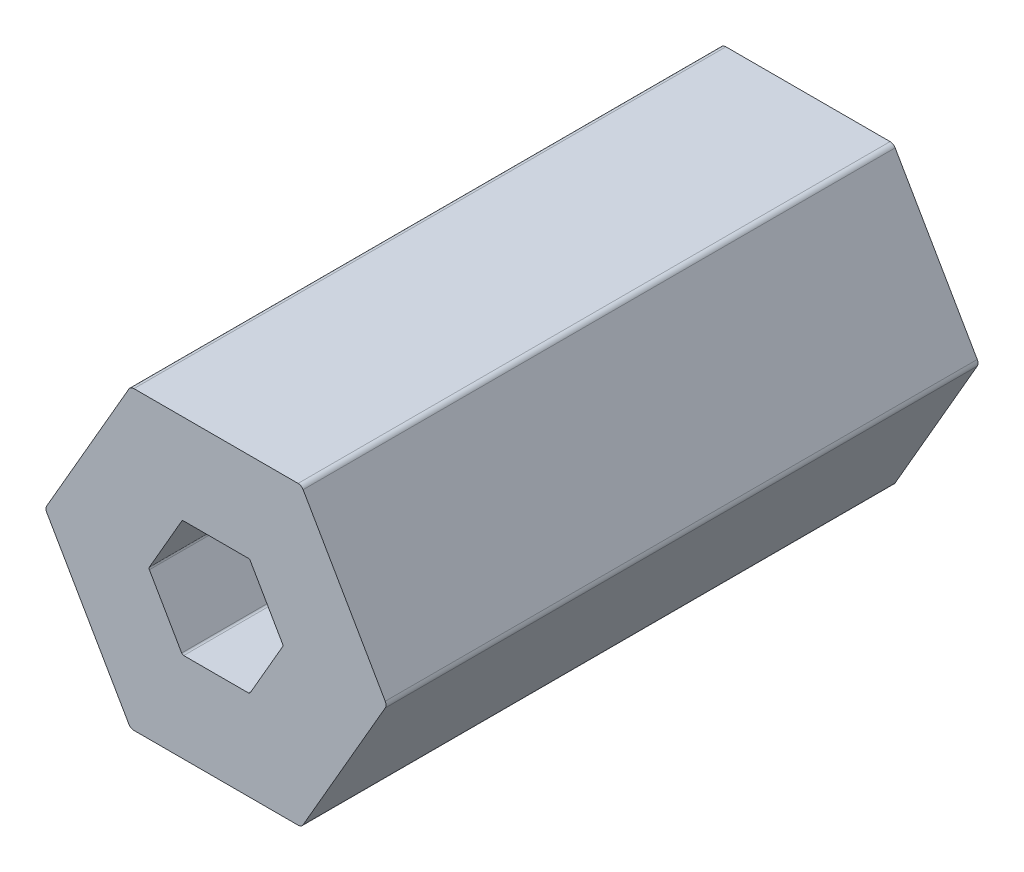
ISO-10303-21;
HEADER;
FILE_DESCRIPTION(('STEP AP214'),'2;1');
FILE_NAME('part.step','',(''),(''),'','','');
FILE_SCHEMA(('AUTOMOTIVE_DESIGN { 1 0 10303 214 1 1 1 1 }'));
ENDSEC;
DATA;
#1=APPLICATION_CONTEXT('core data for automotive mechanical design processes');
#2=APPLICATION_PROTOCOL_DEFINITION('international standard','automotive_design',2000,#1);
#3=PRODUCT_CONTEXT('',#1,'mechanical');
#4=PRODUCT('Part','Part','',(#3));
#5=PRODUCT_RELATED_PRODUCT_CATEGORY('part','',(#4));
#6=PRODUCT_DEFINITION_FORMATION('','',#4);
#7=PRODUCT_DEFINITION_CONTEXT('part definition',#1,'design');
#8=PRODUCT_DEFINITION('design','',#6,#7);
#9=PRODUCT_DEFINITION_SHAPE('','',#8);
#10=(LENGTH_UNIT() NAMED_UNIT(*) SI_UNIT(.MILLI.,.METRE.));
#11=(NAMED_UNIT(*) PLANE_ANGLE_UNIT() SI_UNIT($,.RADIAN.));
#12=(NAMED_UNIT(*) SI_UNIT($,.STERADIAN.) SOLID_ANGLE_UNIT());
#13=UNCERTAINTY_MEASURE_WITH_UNIT(LENGTH_MEASURE(1.E-05),#10,'distance_accuracy_value','');
#14=(GEOMETRIC_REPRESENTATION_CONTEXT(3) GLOBAL_UNCERTAINTY_ASSIGNED_CONTEXT((#13)) GLOBAL_UNIT_ASSIGNED_CONTEXT((#10,
#11,#12)) REPRESENTATION_CONTEXT('',''));
#15=CARTESIAN_POINT('',(0.,0.,0.));
#16=DIRECTION('',(0.,0.,1.));
#17=DIRECTION('',(1.,0.,0.));
#18=AXIS2_PLACEMENT_3D('',#15,#16,#17);
#19=CARTESIAN_POINT('',(2.77128129211021,0.,400.));
#20=DIRECTION('',(0.,0.,1.));
#21=DIRECTION('',(1.,0.,0.));
#22=AXIS2_PLACEMENT_3D('',#19,#20,#21);
#23=CYLINDRICAL_SURFACE('',#22,0.1);
#24=CARTESIAN_POINT('',(2.77128129211021,0.,25.4));
#25=DIRECTION('',(0.,0.,1.));
#26=DIRECTION('',(1.,0.,0.));
#27=AXIS2_PLACEMENT_3D('',#24,#25,#26);
#28=CIRCLE('',#27,0.1);
#29=CARTESIAN_POINT('',(2.85788383248865,0.0500000000000045,25.4));
#30=VERTEX_POINT('',#29);
#31=CARTESIAN_POINT('',(2.8712812921102,0.,25.4));
#32=VERTEX_POINT('',#31);
#33=EDGE_CURVE('E1064',#30,#32,#28,.F.);
#34=ORIENTED_EDGE('',*,*,#33,.F.);
#35=DIRECTION('',(0.,0.,1.));
#36=VECTOR('',#35,1.);
#37=CARTESIAN_POINT('',(2.85788383248865,0.0500000000000085,400.));
#38=LINE('',#37,#36);
#39=CARTESIAN_POINT('',(2.85788383248865,0.0500000000000084,0.));
#40=VERTEX_POINT('',#39);
#41=EDGE_CURVE('E389',#40,#30,#38,.T.);
#42=ORIENTED_EDGE('',*,*,#41,.F.);
#43=CARTESIAN_POINT('',(2.77128129211021,0.,0.));
#44=DIRECTION('',(0.,0.,1.));
#45=DIRECTION('',(1.,0.,0.));
#46=AXIS2_PLACEMENT_3D('',#43,#44,#45);
#47=CIRCLE('',#46,0.1);
#48=CARTESIAN_POINT('',(2.8712812921102,0.,0.));
#49=VERTEX_POINT('',#48);
#50=EDGE_CURVE('E282',#49,#40,#47,.T.);
#51=ORIENTED_EDGE('',*,*,#50,.F.);
#52=DIRECTION('',(0.,0.,1.));
#53=VECTOR('',#52,1.);
#54=CARTESIAN_POINT('',(2.8712812921102,0.,400.));
#55=LINE('',#54,#53);
#56=EDGE_CURVE('E54',#49,#32,#55,.T.);
#57=ORIENTED_EDGE('',*,*,#56,.T.);
#58=EDGE_LOOP('',(#34,#42,#51,#57));
#59=FACE_BOUND('',#58,.T.);
#60=ADVANCED_FACE('F45',(#59),#23,.F.);
#61=CARTESIAN_POINT('',(-7.04367328411341,0.,400.));
#62=DIRECTION('',(0.,0.,-1.));
#63=DIRECTION('',(-1.,0.,0.));
#64=AXIS2_PLACEMENT_3D('',#61,#62,#63);
#65=CYLINDRICAL_SURFACE('',#64,0.25);
#66=DIRECTION('',(0.,0.,-1.));
#67=VECTOR('',#66,1.);
#68=CARTESIAN_POINT('',(-7.26017963505952,-0.125000000000051,400.));
#69=LINE('',#68,#67);
#70=CARTESIAN_POINT('',(-7.26017963505952,-0.12500000000005,25.4));
#71=VERTEX_POINT('',#70);
#72=CARTESIAN_POINT('',(-7.26017963505952,-0.12500000000005,0.));
#73=VERTEX_POINT('',#72);
#74=EDGE_CURVE('E308',#71,#73,#69,.T.);
#75=ORIENTED_EDGE('',*,*,#74,.F.);
#76=CARTESIAN_POINT('',(-7.04367328411341,0.,25.4));
#77=DIRECTION('',(0.,0.,1.));
#78=DIRECTION('',(1.,0.,0.));
#79=AXIS2_PLACEMENT_3D('',#76,#77,#78);
#80=CIRCLE('',#79,0.25);
#81=CARTESIAN_POINT('',(-7.29367328411341,0.,25.4));
#82=VERTEX_POINT('',#81);
#83=EDGE_CURVE('E506',#71,#82,#80,.F.);
#84=ORIENTED_EDGE('',*,*,#83,.T.);
#85=DIRECTION('',(0.,0.,-1.));
#86=VECTOR('',#85,1.);
#87=CARTESIAN_POINT('',(-7.29367328411341,0.,400.));
#88=LINE('',#87,#86);
#89=CARTESIAN_POINT('',(-7.29367328411341,0.,0.));
#90=VERTEX_POINT('',#89);
#91=EDGE_CURVE('E336',#82,#90,#88,.T.);
#92=ORIENTED_EDGE('',*,*,#91,.T.);
#93=CARTESIAN_POINT('',(-7.04367328411341,0.,0.));
#94=DIRECTION('',(0.,0.,-1.));
#95=DIRECTION('',(1.,0.,0.));
#96=AXIS2_PLACEMENT_3D('',#93,#94,#95);
#97=CIRCLE('',#96,0.25);
#98=EDGE_CURVE('E324',#73,#90,#97,.T.);
#99=ORIENTED_EDGE('',*,*,#98,.F.);
#100=EDGE_LOOP('',(#75,#84,#92,#99));
#101=FACE_BOUND('',#100,.T.);
#102=ADVANCED_FACE('F1002',(#101),#65,.T.);
#103=CARTESIAN_POINT('',(3.66617420935418,-6.34999999999993,400.));
#104=DIRECTION('',(-0.866025403784442,0.5,0.));
#105=DIRECTION('',(0.,0.,1.));
#106=AXIS2_PLACEMENT_3D('',#103,#104,#105);
#107=PLANE('',#106);
#108=DIRECTION('',(0.499999999999999,0.866025403784439,0.));
#109=VECTOR('',#108,1.);
#110=CARTESIAN_POINT('',(3.66617420935418,-6.34999999999993,25.4));
#111=LINE('',#110,#109);
#112=CARTESIAN_POINT('',(3.73834299300289,-6.22499999999993,25.4));
#113=VERTEX_POINT('',#112);
#114=CARTESIAN_POINT('',(7.26017963505952,-0.125,25.4));
#115=VERTEX_POINT('',#114);
#116=EDGE_CURVE('E492',#113,#115,#111,.T.);
#117=ORIENTED_EDGE('',*,*,#116,.F.);
#118=DIRECTION('',(0.,0.,-1.));
#119=VECTOR('',#118,1.);
#120=CARTESIAN_POINT('',(3.73834299300288,-6.22499999999993,400.));
#121=LINE('',#120,#119);
#122=CARTESIAN_POINT('',(3.73834299300288,-6.22499999999993,0.));
#123=VERTEX_POINT('',#122);
#124=EDGE_CURVE('E331',#113,#123,#121,.T.);
#125=ORIENTED_EDGE('',*,*,#124,.T.);
#126=DIRECTION('',(0.5,0.866025403784442,0.));
#127=VECTOR('',#126,1.);
#128=CARTESIAN_POINT('',(3.66617420935418,-6.34999999999993,0.));
#129=LINE('',#128,#127);
#130=CARTESIAN_POINT('',(7.26017963505952,-0.125,0.));
#131=VERTEX_POINT('',#130);
#132=EDGE_CURVE('E328',#123,#131,#129,.T.);
#133=ORIENTED_EDGE('',*,*,#132,.T.);
#134=DIRECTION('',(0.,0.,1.));
#135=VECTOR('',#134,1.);
#136=CARTESIAN_POINT('',(7.26017963505952,-0.125,400.));
#137=LINE('',#136,#135);
#138=EDGE_CURVE('E332',#131,#115,#137,.T.);
#139=ORIENTED_EDGE('',*,*,#138,.T.);
#140=EDGE_LOOP('',(#117,#125,#133,#139));
#141=FACE_BOUND('',#140,.T.);
#142=ADVANCED_FACE('F546',(#141),#107,.F.);
#143=CARTESIAN_POINT('',(7.33234841870822,0.,400.));
#144=DIRECTION('',(-0.866025403784438,-0.5,0.));
#145=DIRECTION('',(-0.5,0.866025403784438,0.));
#146=AXIS2_PLACEMENT_3D('',#143,#144,#145);
#147=PLANE('',#146);
#148=DIRECTION('',(-0.5,0.866025403784438,0.));
#149=VECTOR('',#148,1.);
#150=CARTESIAN_POINT('',(7.33234841870822,0.,25.4));
#151=LINE('',#150,#149);
#152=CARTESIAN_POINT('',(7.26017963505952,0.125,25.4));
#153=VERTEX_POINT('',#152);
#154=CARTESIAN_POINT('',(3.7383429930028,6.225,25.4));
#155=VERTEX_POINT('',#154);
#156=EDGE_CURVE('E61',#153,#155,#151,.T.);
#157=ORIENTED_EDGE('',*,*,#156,.F.);
#158=DIRECTION('',(0.,0.,-1.));
#159=VECTOR('',#158,1.);
#160=CARTESIAN_POINT('',(7.26017963505952,0.125,400.));
#161=LINE('',#160,#159);
#162=CARTESIAN_POINT('',(7.26017963505952,0.125,0.));
#163=VERTEX_POINT('',#162);
#164=EDGE_CURVE('E304',#153,#163,#161,.T.);
#165=ORIENTED_EDGE('',*,*,#164,.T.);
#166=DIRECTION('',(-0.5,0.866025403784438,0.));
#167=VECTOR('',#166,1.);
#168=CARTESIAN_POINT('',(7.33234841870822,0.,0.));
#169=LINE('',#168,#167);
#170=CARTESIAN_POINT('',(3.7383429930028,6.225,0.));
#171=VERTEX_POINT('',#170);
#172=EDGE_CURVE('E397',#163,#171,#169,.T.);
#173=ORIENTED_EDGE('',*,*,#172,.T.);
#174=DIRECTION('',(0.,0.,1.));
#175=VECTOR('',#174,1.);
#176=CARTESIAN_POINT('',(3.7383429930028,6.225,400.));
#177=LINE('',#176,#175);
#178=EDGE_CURVE('E380',#171,#155,#177,.T.);
#179=ORIENTED_EDGE('',*,*,#178,.T.);
#180=EDGE_LOOP('',(#157,#165,#173,#179));
#181=FACE_BOUND('',#180,.T.);
#182=ADVANCED_FACE('F983',(#181),#147,.F.);
#183=CARTESIAN_POINT('',(3.6661742093541,6.35,400.));
#184=DIRECTION('',(0.,-1.,0.));
#185=DIRECTION('',(0.,0.,-1.));
#186=AXIS2_PLACEMENT_3D('',#183,#184,#185);
#187=PLANE('',#186);
#188=DIRECTION('',(-1.,0.,0.));
#189=VECTOR('',#188,1.);
#190=CARTESIAN_POINT('',(3.6661742093541,6.35,25.4));
#191=LINE('',#190,#189);
#192=CARTESIAN_POINT('',(3.52183664205669,6.35,25.4));
#193=VERTEX_POINT('',#192);
#194=CARTESIAN_POINT('',(-3.52183664205674,6.34999999999997,25.4));
#195=VERTEX_POINT('',#194);
#196=EDGE_CURVE('E471',#193,#195,#191,.T.);
#197=ORIENTED_EDGE('',*,*,#196,.F.);
#198=DIRECTION('',(0.,0.,-1.));
#199=VECTOR('',#198,1.);
#200=CARTESIAN_POINT('',(3.52183664205669,6.35,400.));
#201=LINE('',#200,#199);
#202=CARTESIAN_POINT('',(3.52183664205669,6.35,0.));
#203=VERTEX_POINT('',#202);
#204=EDGE_CURVE('E353',#193,#203,#201,.T.);
#205=ORIENTED_EDGE('',*,*,#204,.T.);
#206=DIRECTION('',(-1.,0.,0.));
#207=VECTOR('',#206,1.);
#208=CARTESIAN_POINT('',(3.6661742093541,6.35,0.));
#209=LINE('',#208,#207);
#210=CARTESIAN_POINT('',(-3.52183664205673,6.35,0.));
#211=VERTEX_POINT('',#210);
#212=EDGE_CURVE('E370',#203,#211,#209,.T.);
#213=ORIENTED_EDGE('',*,*,#212,.T.);
#214=DIRECTION('',(0.,0.,1.));
#215=VECTOR('',#214,1.);
#216=CARTESIAN_POINT('',(-3.52183664205673,6.35,400.));
#217=LINE('',#216,#215);
#218=EDGE_CURVE('E356',#211,#195,#217,.T.);
#219=ORIENTED_EDGE('',*,*,#218,.T.);
#220=EDGE_LOOP('',(#197,#205,#213,#219));
#221=FACE_BOUND('',#220,.T.);
#222=ADVANCED_FACE('F535',(#221),#187,.F.);
#223=CARTESIAN_POINT('',(-3.66617420935414,6.35,400.));
#224=DIRECTION('',(0.866025403784442,-0.5,0.));
#225=DIRECTION('',(0.,0.,-1.));
#226=AXIS2_PLACEMENT_3D('',#223,#224,#225);
#227=PLANE('',#226);
#228=DIRECTION('',(-0.499999999999999,-0.866025403784439,0.));
#229=VECTOR('',#228,1.);
#230=CARTESIAN_POINT('',(-3.66617420935414,6.35,25.4));
#231=LINE('',#230,#229);
#232=CARTESIAN_POINT('',(-3.73834299300284,6.225,25.4));
#233=VERTEX_POINT('',#232);
#234=CARTESIAN_POINT('',(-7.26017963505957,0.124999999999951,25.4));
#235=VERTEX_POINT('',#234);
#236=EDGE_CURVE('E489',#233,#235,#231,.T.);
#237=ORIENTED_EDGE('',*,*,#236,.F.);
#238=DIRECTION('',(0.,0.,-1.));
#239=VECTOR('',#238,1.);
#240=CARTESIAN_POINT('',(-3.73834299300284,6.225,400.));
#241=LINE('',#240,#239);
#242=CARTESIAN_POINT('',(-3.73834299300284,6.225,0.));
#243=VERTEX_POINT('',#242);
#244=EDGE_CURVE('E313',#233,#243,#241,.T.);
#245=ORIENTED_EDGE('',*,*,#244,.T.);
#246=DIRECTION('',(-0.5,-0.866025403784442,0.));
#247=VECTOR('',#246,1.);
#248=CARTESIAN_POINT('',(-3.66617420935414,6.35,0.));
#249=LINE('',#248,#247);
#250=CARTESIAN_POINT('',(-7.26017963505952,0.124999999999951,0.));
#251=VERTEX_POINT('',#250);
#252=EDGE_CURVE('E357',#243,#251,#249,.T.);
#253=ORIENTED_EDGE('',*,*,#252,.T.);
#254=DIRECTION('',(0.,0.,1.));
#255=VECTOR('',#254,1.);
#256=CARTESIAN_POINT('',(-7.26017963505952,0.124999999999949,400.));
#257=LINE('',#256,#255);
#258=EDGE_CURVE('E377',#251,#235,#257,.T.);
#259=ORIENTED_EDGE('',*,*,#258,.T.);
#260=EDGE_LOOP('',(#237,#245,#253,#259));
#261=FACE_BOUND('',#260,.T.);
#262=ADVANCED_FACE('F963',(#261),#227,.F.);
#263=CARTESIAN_POINT('',(-7.33234841870822,0.,400.));
#264=DIRECTION('',(0.866025403784435,0.500000000000007,0.));
#265=DIRECTION('',(0.,0.,-1.));
#266=AXIS2_PLACEMENT_3D('',#263,#264,#265);
#267=PLANE('',#266);
#268=DIRECTION('',(0.500000000000007,-0.866025403784435,0.));
#269=VECTOR('',#268,1.);
#270=CARTESIAN_POINT('',(-7.33234841870822,0.,25.4));
#271=LINE('',#270,#269);
#272=CARTESIAN_POINT('',(-3.73834299300275,-6.225,25.4));
#273=VERTEX_POINT('',#272);
#274=EDGE_CURVE('E433',#71,#273,#271,.T.);
#275=ORIENTED_EDGE('',*,*,#274,.F.);
#276=ORIENTED_EDGE('',*,*,#74,.T.);
#277=DIRECTION('',(0.500000000000007,-0.866025403784435,0.));
#278=VECTOR('',#277,1.);
#279=CARTESIAN_POINT('',(-7.33234841870822,0.,0.));
#280=LINE('',#279,#278);
#281=CARTESIAN_POINT('',(-3.73834299300275,-6.225,0.));
#282=VERTEX_POINT('',#281);
#283=EDGE_CURVE('E310',#73,#282,#280,.T.);
#284=ORIENTED_EDGE('',*,*,#283,.T.);
#285=DIRECTION('',(0.,0.,1.));
#286=VECTOR('',#285,1.);
#287=CARTESIAN_POINT('',(-3.73834299300275,-6.225,400.));
#288=LINE('',#287,#286);
#289=EDGE_CURVE('E314',#282,#273,#288,.T.);
#290=ORIENTED_EDGE('',*,*,#289,.T.);
#291=EDGE_LOOP('',(#275,#276,#284,#290));
#292=FACE_BOUND('',#291,.T.);
#293=ADVANCED_FACE('F951',(#292),#267,.F.);
#294=CARTESIAN_POINT('',(-3.66617420935405,-6.35,400.));
#295=DIRECTION('',(0.,1.,0.));
#296=DIRECTION('',(1.,0.,0.));
#297=AXIS2_PLACEMENT_3D('',#294,#295,#296);
#298=PLANE('',#297);
#299=DIRECTION('',(1.,0.,0.));
#300=VECTOR('',#299,1.);
#301=CARTESIAN_POINT('',(-3.66617420935405,-6.35,25.4));
#302=LINE('',#301,#300);
#303=CARTESIAN_POINT('',(-3.52183664205664,-6.35,25.4));
#304=VERTEX_POINT('',#303);
#305=CARTESIAN_POINT('',(3.52183664205678,-6.35,25.4));
#306=VERTEX_POINT('',#305);
#307=EDGE_CURVE('E503',#304,#306,#302,.T.);
#308=ORIENTED_EDGE('',*,*,#307,.F.);
#309=DIRECTION('',(0.,0.,-1.));
#310=VECTOR('',#309,1.);
#311=CARTESIAN_POINT('',(-3.52183664205664,-6.35,400.));
#312=LINE('',#311,#310);
#313=CARTESIAN_POINT('',(-3.52183664205664,-6.35,0.));
#314=VERTEX_POINT('',#313);
#315=EDGE_CURVE('E409',#304,#314,#312,.T.);
#316=ORIENTED_EDGE('',*,*,#315,.T.);
#317=DIRECTION('',(1.,0.,0.));
#318=VECTOR('',#317,1.);
#319=CARTESIAN_POINT('',(-3.66617420935405,-6.35,0.));
#320=LINE('',#319,#318);
#321=CARTESIAN_POINT('',(3.52183664205678,-6.35,0.));
#322=VERTEX_POINT('',#321);
#323=EDGE_CURVE('E305',#314,#322,#320,.T.);
#324=ORIENTED_EDGE('',*,*,#323,.T.);
#325=DIRECTION('',(0.,0.,1.));
#326=VECTOR('',#325,1.);
#327=CARTESIAN_POINT('',(3.52183664205678,-6.35,400.));
#328=LINE('',#327,#326);
#329=EDGE_CURVE('E309',#322,#306,#328,.T.);
#330=ORIENTED_EDGE('',*,*,#329,.T.);
#331=EDGE_LOOP('',(#308,#316,#324,#330));
#332=FACE_BOUND('',#331,.T.);
#333=ADVANCED_FACE('F552',(#332),#298,.F.);
#334=CARTESIAN_POINT('',(1.66837567297407,2.110288568297,400.));
#335=DIRECTION('',(-0.866025403784437,-0.5,0.));
#336=DIRECTION('',(-0.5,0.866025403784437,0.));
#337=AXIS2_PLACEMENT_3D('',#334,#335,#336);
#338=PLANE('',#337);
#339=ORIENTED_EDGE('',*,*,#41,.T.);
#340=DIRECTION('',(-0.500000000000001,0.866025403784438,0.));
#341=VECTOR('',#340,1.);
#342=CARTESIAN_POINT('',(1.66837567297407,2.110288568297,25.4));
#343=LINE('',#342,#341);
#344=CARTESIAN_POINT('',(1.47224318643354,2.45,25.4));
#345=VERTEX_POINT('',#344);
#346=EDGE_CURVE('E1069',#30,#345,#343,.T.);
#347=ORIENTED_EDGE('',*,*,#346,.T.);
#348=DIRECTION('',(0.,0.,-1.));
#349=VECTOR('',#348,1.);
#350=CARTESIAN_POINT('',(1.47224318643354,2.45,0.));
#351=LINE('',#350,#349);
#352=CARTESIAN_POINT('',(1.47224318643354,2.45,0.));
#353=VERTEX_POINT('',#352);
#354=EDGE_CURVE('E269',#345,#353,#351,.T.);
#355=ORIENTED_EDGE('',*,*,#354,.T.);
#356=DIRECTION('',(-0.5,0.866025403784437,0.));
#357=VECTOR('',#356,1.);
#358=CARTESIAN_POINT('',(1.66837567297407,2.110288568297,0.));
#359=LINE('',#358,#357);
#360=EDGE_CURVE('E286',#40,#353,#359,.T.);
#361=ORIENTED_EDGE('',*,*,#360,.F.);
#362=EDGE_LOOP('',(#339,#347,#355,#361));
#363=FACE_BOUND('',#362,.T.);
#364=ADVANCED_FACE('F932',(#363),#338,.T.);
#365=CARTESIAN_POINT('',(-0.993375672974064,2.5,400.));
#366=DIRECTION('',(0.,-1.,0.));
#367=DIRECTION('',(0.,0.,-1.));
#368=AXIS2_PLACEMENT_3D('',#365,#366,#367);
#369=PLANE('',#368);
#370=DIRECTION('',(0.,0.,1.));
#371=VECTOR('',#370,1.);
#372=CARTESIAN_POINT('',(1.38564064605509,2.5,400.));
#373=LINE('',#372,#371);
#374=CARTESIAN_POINT('',(1.38564064605509,2.5,0.));
#375=VERTEX_POINT('',#374);
#376=CARTESIAN_POINT('',(1.38564064605509,2.50000000000001,25.4));
#377=VERTEX_POINT('',#376);
#378=EDGE_CURVE('E255',#375,#377,#373,.T.);
#379=ORIENTED_EDGE('',*,*,#378,.T.);
#380=DIRECTION('',(-1.,0.,0.));
#381=VECTOR('',#380,1.);
#382=CARTESIAN_POINT('',(-0.993375672974064,2.5,25.4));
#383=LINE('',#382,#381);
#384=CARTESIAN_POINT('',(-1.38564064605511,2.5,25.4));
#385=VERTEX_POINT('',#384);
#386=EDGE_CURVE('E243',#377,#385,#383,.T.);
#387=ORIENTED_EDGE('',*,*,#386,.T.);
#388=DIRECTION('',(0.,0.,-1.));
#389=VECTOR('',#388,1.);
#390=CARTESIAN_POINT('',(-1.38564064605511,2.5,0.));
#391=LINE('',#390,#389);
#392=CARTESIAN_POINT('',(-1.38564064605511,2.5,0.));
#393=VERTEX_POINT('',#392);
#394=EDGE_CURVE('E252',#385,#393,#391,.T.);
#395=ORIENTED_EDGE('',*,*,#394,.T.);
#396=DIRECTION('',(-1.,0.,0.));
#397=VECTOR('',#396,1.);
#398=CARTESIAN_POINT('',(-0.993375672974064,2.5,0.));
#399=LINE('',#398,#397);
#400=EDGE_CURVE('E300',#375,#393,#399,.T.);
#401=ORIENTED_EDGE('',*,*,#400,.F.);
#402=EDGE_LOOP('',(#379,#387,#395,#401));
#403=FACE_BOUND('',#402,.T.);
#404=ADVANCED_FACE('F251',(#403),#369,.T.);
#405=CARTESIAN_POINT('',(-2.66175134594813,0.389711431702997,400.));
#406=DIRECTION('',(0.86602540378444,-0.5,0.));
#407=DIRECTION('',(0.,0.,-1.));
#408=AXIS2_PLACEMENT_3D('',#405,#406,#407);
#409=PLANE('',#408);
#410=DIRECTION('',(0.,0.,1.));
#411=VECTOR('',#410,1.);
#412=CARTESIAN_POINT('',(-1.47224318643355,2.45,400.));
#413=LINE('',#412,#411);
#414=CARTESIAN_POINT('',(-1.47224318643355,2.45,0.));
#415=VERTEX_POINT('',#414);
#416=CARTESIAN_POINT('',(-1.47224318643355,2.45,25.4));
#417=VERTEX_POINT('',#416);
#418=EDGE_CURVE('E271',#415,#417,#413,.T.);
#419=ORIENTED_EDGE('',*,*,#418,.T.);
#420=DIRECTION('',(-0.499999999999999,-0.866025403784439,0.));
#421=VECTOR('',#420,1.);
#422=CARTESIAN_POINT('',(-2.66175134594813,0.389711431702997,25.4));
#423=LINE('',#422,#421);
#424=CARTESIAN_POINT('',(-2.85788383248865,0.0499999999999911,25.4));
#425=VERTEX_POINT('',#424);
#426=EDGE_CURVE('E68',#417,#425,#423,.T.);
#427=ORIENTED_EDGE('',*,*,#426,.T.);
#428=DIRECTION('',(0.,0.,-1.));
#429=VECTOR('',#428,1.);
#430=CARTESIAN_POINT('',(-2.85788383248865,0.0499999999999911,0.));
#431=LINE('',#430,#429);
#432=CARTESIAN_POINT('',(-2.85788383248865,0.0499999999999911,0.));
#433=VERTEX_POINT('',#432);
#434=EDGE_CURVE('E264',#425,#433,#431,.T.);
#435=ORIENTED_EDGE('',*,*,#434,.T.);
#436=DIRECTION('',(-0.5,-0.86602540378444,0.));
#437=VECTOR('',#436,1.);
#438=CARTESIAN_POINT('',(-2.66175134594813,0.389711431702997,0.));
#439=LINE('',#438,#437);
#440=EDGE_CURVE('E275',#415,#433,#439,.T.);
#441=ORIENTED_EDGE('',*,*,#440,.F.);
#442=EDGE_LOOP('',(#419,#427,#435,#441));
#443=FACE_BOUND('',#442,.T.);
#444=ADVANCED_FACE('F911',(#443),#409,.T.);
#445=CARTESIAN_POINT('',(-1.71837567297406,-2.02368602791856,400.));
#446=DIRECTION('',(0.866025403784437,0.5,0.));
#447=DIRECTION('',(0.,0.,-1.));
#448=AXIS2_PLACEMENT_3D('',#445,#446,#447);
#449=PLANE('',#448);
#450=DIRECTION('',(0.,0.,1.));
#451=VECTOR('',#450,1.);
#452=CARTESIAN_POINT('',(-2.85788383248865,-0.0500000000000092,400.));
#453=LINE('',#452,#451);
#454=CARTESIAN_POINT('',(-2.85788383248865,-0.0500000000000101,0.));
#455=VERTEX_POINT('',#454);
#456=CARTESIAN_POINT('',(-2.85788383248865,-0.0500000000000083,25.4));
#457=VERTEX_POINT('',#456);
#458=EDGE_CURVE('E277',#455,#457,#453,.T.);
#459=ORIENTED_EDGE('',*,*,#458,.T.);
#460=DIRECTION('',(0.500000000000001,-0.866025403784438,0.));
#461=VECTOR('',#460,1.);
#462=CARTESIAN_POINT('',(-1.71837567297406,-2.02368602791856,25.4));
#463=LINE('',#462,#461);
#464=CARTESIAN_POINT('',(-1.47224318643355,-2.45,25.4));
#465=VERTEX_POINT('',#464);
#466=EDGE_CURVE('E1075',#457,#465,#463,.T.);
#467=ORIENTED_EDGE('',*,*,#466,.T.);
#468=DIRECTION('',(0.,0.,-1.));
#469=VECTOR('',#468,1.);
#470=CARTESIAN_POINT('',(-1.47224318643354,-2.45,0.));
#471=LINE('',#470,#469);
#472=CARTESIAN_POINT('',(-1.47224318643354,-2.45,0.));
#473=VERTEX_POINT('',#472);
#474=EDGE_CURVE('E280',#465,#473,#471,.T.);
#475=ORIENTED_EDGE('',*,*,#474,.T.);
#476=DIRECTION('',(0.5,-0.866025403784437,0.));
#477=VECTOR('',#476,1.);
#478=CARTESIAN_POINT('',(-1.71837567297406,-2.02368602791856,0.));
#479=LINE('',#478,#477);
#480=EDGE_CURVE('E348',#455,#473,#479,.T.);
#481=ORIENTED_EDGE('',*,*,#480,.F.);
#482=EDGE_LOOP('',(#459,#467,#475,#481));
#483=FACE_BOUND('',#482,.T.);
#484=ADVANCED_FACE('F900',(#483),#449,.T.);
#485=CARTESIAN_POINT('',(0.893375672974065,-2.5,400.));
#486=DIRECTION('',(0.,1.,0.));
#487=DIRECTION('',(1.,0.,0.));
#488=AXIS2_PLACEMENT_3D('',#485,#486,#487);
#489=PLANE('',#488);
#490=DIRECTION('',(0.,0.,1.));
#491=VECTOR('',#490,1.);
#492=CARTESIAN_POINT('',(-1.3856406460551,-2.5,400.));
#493=LINE('',#492,#491);
#494=CARTESIAN_POINT('',(-1.3856406460551,-2.5,0.));
#495=VERTEX_POINT('',#494);
#496=CARTESIAN_POINT('',(-1.3856406460551,-2.5,25.4));
#497=VERTEX_POINT('',#496);
#498=EDGE_CURVE('E281',#495,#497,#493,.T.);
#499=ORIENTED_EDGE('',*,*,#498,.T.);
#500=DIRECTION('',(1.,0.,0.));
#501=VECTOR('',#500,1.);
#502=CARTESIAN_POINT('',(0.893375672974065,-2.5,25.4));
#503=LINE('',#502,#501);
#504=CARTESIAN_POINT('',(1.3856406460551,-2.5,25.4));
#505=VERTEX_POINT('',#504);
#506=EDGE_CURVE('E467',#497,#505,#503,.T.);
#507=ORIENTED_EDGE('',*,*,#506,.T.);
#508=DIRECTION('',(0.,0.,-1.));
#509=VECTOR('',#508,1.);
#510=CARTESIAN_POINT('',(1.3856406460551,-2.5,0.));
#511=LINE('',#510,#509);
#512=CARTESIAN_POINT('',(1.3856406460551,-2.5,0.));
#513=VERTEX_POINT('',#512);
#514=EDGE_CURVE('E361',#505,#513,#511,.T.);
#515=ORIENTED_EDGE('',*,*,#514,.T.);
#516=DIRECTION('',(1.,0.,0.));
#517=VECTOR('',#516,1.);
#518=CARTESIAN_POINT('',(0.893375672974065,-2.5,0.));
#519=LINE('',#518,#517);
#520=EDGE_CURVE('E352',#495,#513,#519,.T.);
#521=ORIENTED_EDGE('',*,*,#520,.F.);
#522=EDGE_LOOP('',(#499,#507,#515,#521));
#523=FACE_BOUND('',#522,.T.);
#524=ADVANCED_FACE('F890',(#523),#489,.T.);
#525=CARTESIAN_POINT('',(1.66837567297407,-2.110288568297,400.));
#526=DIRECTION('',(-0.866025403784439,0.5,0.));
#527=DIRECTION('',(0.,0.,1.));
#528=AXIS2_PLACEMENT_3D('',#525,#526,#527);
#529=PLANE('',#528);
#530=DIRECTION('',(0.,0.,1.));
#531=VECTOR('',#530,1.);
#532=CARTESIAN_POINT('',(1.47224318643355,-2.45,400.));
#533=LINE('',#532,#531);
#534=CARTESIAN_POINT('',(1.47224318643355,-2.45,0.));
#535=VERTEX_POINT('',#534);
#536=CARTESIAN_POINT('',(1.47224318643354,-2.45,25.4));
#537=VERTEX_POINT('',#536);
#538=EDGE_CURVE('E383',#535,#537,#533,.T.);
#539=ORIENTED_EDGE('',*,*,#538,.T.);
#540=DIRECTION('',(0.5,0.866025403784439,0.));
#541=VECTOR('',#540,1.);
#542=CARTESIAN_POINT('',(1.66837567297407,-2.110288568297,25.4));
#543=LINE('',#542,#541);
#544=CARTESIAN_POINT('',(2.85788383248865,-0.0499999999999914,25.4));
#545=VERTEX_POINT('',#544);
#546=EDGE_CURVE('E473',#537,#545,#543,.T.);
#547=ORIENTED_EDGE('',*,*,#546,.T.);
#548=DIRECTION('',(0.,0.,-1.));
#549=VECTOR('',#548,1.);
#550=CARTESIAN_POINT('',(2.85788383248865,-0.0499999999999919,0.));
#551=LINE('',#550,#549);
#552=CARTESIAN_POINT('',(2.85788383248865,-0.0499999999999923,0.));
#553=VERTEX_POINT('',#552);
#554=EDGE_CURVE('E430',#545,#553,#551,.T.);
#555=ORIENTED_EDGE('',*,*,#554,.T.);
#556=DIRECTION('',(0.5,0.866025403784439,0.));
#557=VECTOR('',#556,1.);
#558=CARTESIAN_POINT('',(1.66837567297407,-2.110288568297,0.));
#559=LINE('',#558,#557);
#560=EDGE_CURVE('E294',#535,#553,#559,.T.);
#561=ORIENTED_EDGE('',*,*,#560,.F.);
#562=EDGE_LOOP('',(#539,#547,#555,#561));
#563=FACE_BOUND('',#562,.T.);
#564=ADVANCED_FACE('F457',(#563),#529,.T.);
#565=CARTESIAN_POINT('',(3.52183664205677,-6.1,400.));
#566=DIRECTION('',(0.,0.,-1.));
#567=DIRECTION('',(-1.,0.,0.));
#568=AXIS2_PLACEMENT_3D('',#565,#566,#567);
#569=CYLINDRICAL_SURFACE('',#568,0.25);
#570=ORIENTED_EDGE('',*,*,#124,.F.);
#571=CARTESIAN_POINT('',(3.52183664205677,-6.1,25.4));
#572=DIRECTION('',(0.,0.,1.));
#573=DIRECTION('',(1.,0.,0.));
#574=AXIS2_PLACEMENT_3D('',#571,#572,#573);
#575=CIRCLE('',#574,0.25);
#576=EDGE_CURVE('E499',#113,#306,#575,.F.);
#577=ORIENTED_EDGE('',*,*,#576,.T.);
#578=ORIENTED_EDGE('',*,*,#329,.F.);
#579=CARTESIAN_POINT('',(3.52183664205677,-6.1,0.));
#580=DIRECTION('',(0.,0.,-1.));
#581=DIRECTION('',(1.,0.,0.));
#582=AXIS2_PLACEMENT_3D('',#579,#580,#581);
#583=CIRCLE('',#582,0.25);
#584=EDGE_CURVE('E337',#123,#322,#583,.T.);
#585=ORIENTED_EDGE('',*,*,#584,.F.);
#586=EDGE_LOOP('',(#570,#577,#578,#585));
#587=FACE_BOUND('',#586,.T.);
#588=ADVANCED_FACE('F551',(#587),#569,.T.);
#589=CARTESIAN_POINT('',(-3.52183664205664,-6.1,400.));
#590=DIRECTION('',(0.,0.,-1.));
#591=DIRECTION('',(-1.,0.,0.));
#592=AXIS2_PLACEMENT_3D('',#589,#590,#591);
#593=CYLINDRICAL_SURFACE('',#592,0.25);
#594=ORIENTED_EDGE('',*,*,#315,.F.);
#595=CARTESIAN_POINT('',(-3.52183664205664,-6.1,25.4));
#596=DIRECTION('',(0.,0.,1.));
#597=DIRECTION('',(1.,0.,0.));
#598=AXIS2_PLACEMENT_3D('',#595,#596,#597);
#599=CIRCLE('',#598,0.25);
#600=EDGE_CURVE('E510',#304,#273,#599,.F.);
#601=ORIENTED_EDGE('',*,*,#600,.T.);
#602=ORIENTED_EDGE('',*,*,#289,.F.);
#603=CARTESIAN_POINT('',(-3.52183664205664,-6.1,0.));
#604=DIRECTION('',(0.,0.,-1.));
#605=DIRECTION('',(1.,0.,0.));
#606=AXIS2_PLACEMENT_3D('',#603,#604,#605);
#607=CIRCLE('',#606,0.25);
#608=EDGE_CURVE('E341',#314,#282,#607,.T.);
#609=ORIENTED_EDGE('',*,*,#608,.F.);
#610=EDGE_LOOP('',(#594,#601,#602,#609));
#611=FACE_BOUND('',#610,.T.);
#612=ADVANCED_FACE('F558',(#611),#593,.T.);
#613=CARTESIAN_POINT('',(-7.04367328411341,0.,400.));
#614=DIRECTION('',(0.,0.,-1.));
#615=DIRECTION('',(-1.,0.,0.));
#616=AXIS2_PLACEMENT_3D('',#613,#614,#615);
#617=CYLINDRICAL_SURFACE('',#616,0.25);
#618=ORIENTED_EDGE('',*,*,#91,.F.);
#619=CARTESIAN_POINT('',(-7.04367328411341,0.,25.4));
#620=DIRECTION('',(0.,0.,1.));
#621=DIRECTION('',(1.,0.,0.));
#622=AXIS2_PLACEMENT_3D('',#619,#620,#621);
#623=CIRCLE('',#622,0.25);
#624=EDGE_CURVE('E495',#82,#235,#623,.F.);
#625=ORIENTED_EDGE('',*,*,#624,.T.);
#626=ORIENTED_EDGE('',*,*,#258,.F.);
#627=CARTESIAN_POINT('',(-7.04367328411341,0.,0.));
#628=DIRECTION('',(0.,0.,-1.));
#629=DIRECTION('',(1.,0.,0.));
#630=AXIS2_PLACEMENT_3D('',#627,#628,#629);
#631=CIRCLE('',#630,0.25);
#632=EDGE_CURVE('E320',#90,#251,#631,.T.);
#633=ORIENTED_EDGE('',*,*,#632,.F.);
#634=EDGE_LOOP('',(#618,#625,#626,#633));
#635=FACE_BOUND('',#634,.T.);
#636=ADVANCED_FACE('F847',(#635),#617,.T.);
#637=CARTESIAN_POINT('',(-3.52183664205673,6.1,400.));
#638=DIRECTION('',(0.,0.,-1.));
#639=DIRECTION('',(-1.,0.,0.));
#640=AXIS2_PLACEMENT_3D('',#637,#638,#639);
#641=CYLINDRICAL_SURFACE('',#640,0.25);
#642=ORIENTED_EDGE('',*,*,#244,.F.);
#643=CARTESIAN_POINT('',(-3.52183664205673,6.1,25.4));
#644=DIRECTION('',(0.,0.,1.));
#645=DIRECTION('',(1.,0.,0.));
#646=AXIS2_PLACEMENT_3D('',#643,#644,#645);
#647=CIRCLE('',#646,0.25);
#648=EDGE_CURVE('E485',#233,#195,#647,.F.);
#649=ORIENTED_EDGE('',*,*,#648,.T.);
#650=ORIENTED_EDGE('',*,*,#218,.F.);
#651=CARTESIAN_POINT('',(-3.52183664205673,6.1,0.));
#652=DIRECTION('',(0.,0.,-1.));
#653=DIRECTION('',(1.,0.,0.));
#654=AXIS2_PLACEMENT_3D('',#651,#652,#653);
#655=CIRCLE('',#654,0.25);
#656=EDGE_CURVE('E325',#243,#211,#655,.T.);
#657=ORIENTED_EDGE('',*,*,#656,.F.);
#658=EDGE_LOOP('',(#642,#649,#650,#657));
#659=FACE_BOUND('',#658,.T.);
#660=ADVANCED_FACE('F532',(#659),#641,.T.);
#661=CARTESIAN_POINT('',(7.04367328411341,0.,400.));
#662=DIRECTION('',(0.,0.,-1.));
#663=DIRECTION('',(-1.,0.,0.));
#664=AXIS2_PLACEMENT_3D('',#661,#662,#663);
#665=CYLINDRICAL_SURFACE('',#664,0.25);
#666=ORIENTED_EDGE('',*,*,#164,.F.);
#667=CARTESIAN_POINT('',(7.04367328411341,0.,25.4));
#668=DIRECTION('',(0.,0.,1.));
#669=DIRECTION('',(1.,0.,0.));
#670=AXIS2_PLACEMENT_3D('',#667,#668,#669);
#671=CIRCLE('',#670,0.25);
#672=EDGE_CURVE('E481',#153,#115,#671,.F.);
#673=ORIENTED_EDGE('',*,*,#672,.T.);
#674=ORIENTED_EDGE('',*,*,#138,.F.);
#675=CARTESIAN_POINT('',(7.04367328411341,0.,0.));
#676=DIRECTION('',(0.,0.,-1.));
#677=DIRECTION('',(1.,0.,0.));
#678=AXIS2_PLACEMENT_3D('',#675,#676,#677);
#679=CIRCLE('',#678,0.25);
#680=EDGE_CURVE('E315',#163,#131,#679,.T.);
#681=ORIENTED_EDGE('',*,*,#680,.F.);
#682=EDGE_LOOP('',(#666,#673,#674,#681));
#683=FACE_BOUND('',#682,.T.);
#684=ADVANCED_FACE('F543',(#683),#665,.T.);
#685=CARTESIAN_POINT('',(3.52183664205669,6.1,400.));
#686=DIRECTION('',(0.,0.,-1.));
#687=DIRECTION('',(-1.,0.,0.));
#688=AXIS2_PLACEMENT_3D('',#685,#686,#687);
#689=CYLINDRICAL_SURFACE('',#688,0.25);
#690=ORIENTED_EDGE('',*,*,#204,.F.);
#691=CARTESIAN_POINT('',(3.52183664205669,6.1,25.4));
#692=DIRECTION('',(0.,0.,1.));
#693=DIRECTION('',(1.,0.,0.));
#694=AXIS2_PLACEMENT_3D('',#691,#692,#693);
#695=CIRCLE('',#694,0.25);
#696=EDGE_CURVE('E466',#193,#155,#695,.F.);
#697=ORIENTED_EDGE('',*,*,#696,.T.);
#698=ORIENTED_EDGE('',*,*,#178,.F.);
#699=CARTESIAN_POINT('',(3.52183664205669,6.1,0.));
#700=DIRECTION('',(0.,0.,-1.));
#701=DIRECTION('',(1.,0.,0.));
#702=AXIS2_PLACEMENT_3D('',#699,#700,#701);
#703=CIRCLE('',#702,0.25);
#704=EDGE_CURVE('E319',#203,#171,#703,.T.);
#705=ORIENTED_EDGE('',*,*,#704,.F.);
#706=EDGE_LOOP('',(#690,#697,#698,#705));
#707=FACE_BOUND('',#706,.T.);
#708=ADVANCED_FACE('F538',(#707),#689,.T.);
#709=CARTESIAN_POINT('',(-1.3856406460551,-2.4,400.));
#710=DIRECTION('',(0.,0.,1.));
#711=DIRECTION('',(1.,0.,0.));
#712=AXIS2_PLACEMENT_3D('',#709,#710,#711);
#713=CYLINDRICAL_SURFACE('',#712,0.1);
#714=CARTESIAN_POINT('',(-1.3856406460551,-2.4,25.4));
#715=DIRECTION('',(0.,0.,1.));
#716=DIRECTION('',(1.,0.,0.));
#717=AXIS2_PLACEMENT_3D('',#714,#715,#716);
#718=CIRCLE('',#717,0.1);
#719=EDGE_CURVE('E1073',#497,#465,#718,.F.);
#720=ORIENTED_EDGE('',*,*,#719,.F.);
#721=ORIENTED_EDGE('',*,*,#498,.F.);
#722=CARTESIAN_POINT('',(-1.3856406460551,-2.4,0.));
#723=DIRECTION('',(0.,0.,1.));
#724=DIRECTION('',(1.,0.,0.));
#725=AXIS2_PLACEMENT_3D('',#722,#723,#724);
#726=CIRCLE('',#725,0.1);
#727=EDGE_CURVE('E374',#473,#495,#726,.T.);
#728=ORIENTED_EDGE('',*,*,#727,.F.);
#729=ORIENTED_EDGE('',*,*,#474,.F.);
#730=EDGE_LOOP('',(#720,#721,#728,#729));
#731=FACE_BOUND('',#730,.T.);
#732=ADVANCED_FACE('F800',(#731),#713,.F.);
#733=CARTESIAN_POINT('',(-2.77128129211021,0.,400.));
#734=DIRECTION('',(0.,0.,1.));
#735=DIRECTION('',(1.,0.,0.));
#736=AXIS2_PLACEMENT_3D('',#733,#734,#735);
#737=CYLINDRICAL_SURFACE('',#736,0.1);
#738=CARTESIAN_POINT('',(-2.77128129211021,0.,25.4));
#739=DIRECTION('',(0.,0.,1.));
#740=DIRECTION('',(1.,0.,0.));
#741=AXIS2_PLACEMENT_3D('',#738,#739,#740);
#742=CIRCLE('',#741,0.1);
#743=EDGE_CURVE('E1089',#457,#425,#742,.F.);
#744=ORIENTED_EDGE('',*,*,#743,.F.);
#745=ORIENTED_EDGE('',*,*,#458,.F.);
#746=CARTESIAN_POINT('',(-2.77128129211021,0.,0.));
#747=DIRECTION('',(0.,0.,1.));
#748=DIRECTION('',(1.,0.,0.));
#749=AXIS2_PLACEMENT_3D('',#746,#747,#748);
#750=CIRCLE('',#749,0.1);
#751=EDGE_CURVE('E344',#433,#455,#750,.T.);
#752=ORIENTED_EDGE('',*,*,#751,.F.);
#753=ORIENTED_EDGE('',*,*,#434,.F.);
#754=EDGE_LOOP('',(#744,#745,#752,#753));
#755=FACE_BOUND('',#754,.T.);
#756=ADVANCED_FACE('F789',(#755),#737,.F.);
#757=CARTESIAN_POINT('',(1.3856406460551,-2.4,400.));
#758=DIRECTION('',(0.,0.,1.));
#759=DIRECTION('',(1.,0.,0.));
#760=AXIS2_PLACEMENT_3D('',#757,#758,#759);
#761=CYLINDRICAL_SURFACE('',#760,0.1);
#762=CARTESIAN_POINT('',(1.3856406460551,-2.4,25.4));
#763=DIRECTION('',(0.,0.,1.));
#764=DIRECTION('',(1.,0.,0.));
#765=AXIS2_PLACEMENT_3D('',#762,#763,#764);
#766=CIRCLE('',#765,0.1);
#767=EDGE_CURVE('E463',#537,#505,#766,.F.);
#768=ORIENTED_EDGE('',*,*,#767,.F.);
#769=ORIENTED_EDGE('',*,*,#538,.F.);
#770=CARTESIAN_POINT('',(1.3856406460551,-2.4,0.));
#771=DIRECTION('',(0.,0.,1.));
#772=DIRECTION('',(1.,0.,0.));
#773=AXIS2_PLACEMENT_3D('',#770,#771,#772);
#774=CIRCLE('',#773,0.1);
#775=EDGE_CURVE('E349',#513,#535,#774,.T.);
#776=ORIENTED_EDGE('',*,*,#775,.F.);
#777=ORIENTED_EDGE('',*,*,#514,.F.);
#778=EDGE_LOOP('',(#768,#769,#776,#777));
#779=FACE_BOUND('',#778,.T.);
#780=ADVANCED_FACE('F47',(#779),#761,.F.);
#781=CARTESIAN_POINT('',(2.77128129211021,0.,400.));
#782=DIRECTION('',(0.,0.,1.));
#783=DIRECTION('',(1.,0.,0.));
#784=AXIS2_PLACEMENT_3D('',#781,#782,#783);
#785=CYLINDRICAL_SURFACE('',#784,0.1);
#786=CARTESIAN_POINT('',(2.77128129211021,0.,25.4));
#787=DIRECTION('',(0.,0.,1.));
#788=DIRECTION('',(1.,0.,0.));
#789=AXIS2_PLACEMENT_3D('',#786,#787,#788);
#790=CIRCLE('',#789,0.1);
#791=EDGE_CURVE('E1068',#32,#545,#790,.F.);
#792=ORIENTED_EDGE('',*,*,#791,.F.);
#793=ORIENTED_EDGE('',*,*,#56,.F.);
#794=CARTESIAN_POINT('',(2.77128129211021,0.,0.));
#795=DIRECTION('',(0.,0.,1.));
#796=DIRECTION('',(1.,0.,0.));
#797=AXIS2_PLACEMENT_3D('',#794,#795,#796);
#798=CIRCLE('',#797,0.1);
#799=EDGE_CURVE('E285',#553,#49,#798,.T.);
#800=ORIENTED_EDGE('',*,*,#799,.F.);
#801=ORIENTED_EDGE('',*,*,#554,.F.);
#802=EDGE_LOOP('',(#792,#793,#800,#801));
#803=FACE_BOUND('',#802,.T.);
#804=ADVANCED_FACE('F764',(#803),#785,.F.);
#805=CARTESIAN_POINT('',(1.3856406460551,2.4,400.));
#806=DIRECTION('',(0.,0.,1.));
#807=DIRECTION('',(1.,0.,0.));
#808=AXIS2_PLACEMENT_3D('',#805,#806,#807);
#809=CYLINDRICAL_SURFACE('',#808,0.1);
#810=CARTESIAN_POINT('',(1.3856406460551,2.4,25.4));
#811=DIRECTION('',(0.,0.,1.));
#812=DIRECTION('',(1.,0.,0.));
#813=AXIS2_PLACEMENT_3D('',#810,#811,#812);
#814=CIRCLE('',#813,0.1);
#815=EDGE_CURVE('E257',#377,#345,#814,.F.);
#816=ORIENTED_EDGE('',*,*,#815,.F.);
#817=ORIENTED_EDGE('',*,*,#378,.F.);
#818=CARTESIAN_POINT('',(1.3856406460551,2.4,0.));
#819=DIRECTION('',(0.,0.,1.));
#820=DIRECTION('',(1.,0.,0.));
#821=AXIS2_PLACEMENT_3D('',#818,#819,#820);
#822=CIRCLE('',#821,0.1);
#823=EDGE_CURVE('E295',#353,#375,#822,.T.);
#824=ORIENTED_EDGE('',*,*,#823,.F.);
#825=ORIENTED_EDGE('',*,*,#354,.F.);
#826=EDGE_LOOP('',(#816,#817,#824,#825));
#827=FACE_BOUND('',#826,.T.);
#828=ADVANCED_FACE('F750',(#827),#809,.F.);
#829=CARTESIAN_POINT('',(-1.38564064605511,2.4,400.));
#830=DIRECTION('',(0.,0.,1.));
#831=DIRECTION('',(1.,0.,0.));
#832=AXIS2_PLACEMENT_3D('',#829,#830,#831);
#833=CYLINDRICAL_SURFACE('',#832,0.1);
#834=CARTESIAN_POINT('',(-1.38564064605511,2.4,25.4));
#835=DIRECTION('',(0.,0.,1.));
#836=DIRECTION('',(1.,0.,0.));
#837=AXIS2_PLACEMENT_3D('',#834,#835,#836);
#838=CIRCLE('',#837,0.1);
#839=EDGE_CURVE('E11',#417,#385,#838,.F.);
#840=ORIENTED_EDGE('',*,*,#839,.F.);
#841=ORIENTED_EDGE('',*,*,#418,.F.);
#842=CARTESIAN_POINT('',(-1.38564064605511,2.4,0.));
#843=DIRECTION('',(0.,0.,1.));
#844=DIRECTION('',(1.,0.,0.));
#845=AXIS2_PLACEMENT_3D('',#842,#843,#844);
#846=CIRCLE('',#845,0.1);
#847=EDGE_CURVE('E261',#393,#415,#846,.T.);
#848=ORIENTED_EDGE('',*,*,#847,.F.);
#849=ORIENTED_EDGE('',*,*,#394,.F.);
#850=EDGE_LOOP('',(#840,#841,#848,#849));
#851=FACE_BOUND('',#850,.T.);
#852=ADVANCED_FACE('F259',(#851),#833,.F.);
#853=CARTESIAN_POINT('',(0.,0.,0.));
#854=DIRECTION('',(0.,0.,1.));
#855=DIRECTION('',(1.,0.,0.));
#856=AXIS2_PLACEMENT_3D('',#853,#854,#855);
#857=PLANE('',#856);
#858=ORIENTED_EDGE('',*,*,#132,.F.);
#859=ORIENTED_EDGE('',*,*,#584,.T.);
#860=ORIENTED_EDGE('',*,*,#323,.F.);
#861=ORIENTED_EDGE('',*,*,#608,.T.);
#862=ORIENTED_EDGE('',*,*,#283,.F.);
#863=ORIENTED_EDGE('',*,*,#98,.T.);
#864=ORIENTED_EDGE('',*,*,#632,.T.);
#865=ORIENTED_EDGE('',*,*,#252,.F.);
#866=ORIENTED_EDGE('',*,*,#656,.T.);
#867=ORIENTED_EDGE('',*,*,#212,.F.);
#868=ORIENTED_EDGE('',*,*,#704,.T.);
#869=ORIENTED_EDGE('',*,*,#172,.F.);
#870=ORIENTED_EDGE('',*,*,#680,.T.);
#871=EDGE_LOOP('',(#858,#859,#860,#861,#862,#863,#864,#865,#866,#867,#868,#869,#870));
#872=FACE_BOUND('',#871,.T.);
#873=ORIENTED_EDGE('',*,*,#560,.T.);
#874=ORIENTED_EDGE('',*,*,#799,.T.);
#875=ORIENTED_EDGE('',*,*,#50,.T.);
#876=ORIENTED_EDGE('',*,*,#360,.T.);
#877=ORIENTED_EDGE('',*,*,#823,.T.);
#878=ORIENTED_EDGE('',*,*,#400,.T.);
#879=ORIENTED_EDGE('',*,*,#847,.T.);
#880=ORIENTED_EDGE('',*,*,#440,.T.);
#881=ORIENTED_EDGE('',*,*,#751,.T.);
#882=ORIENTED_EDGE('',*,*,#480,.T.);
#883=ORIENTED_EDGE('',*,*,#727,.T.);
#884=ORIENTED_EDGE('',*,*,#520,.T.);
#885=ORIENTED_EDGE('',*,*,#775,.T.);
#886=EDGE_LOOP('',(#873,#874,#875,#876,#877,#878,#879,#880,#881,#882,#883,#884,#885));
#887=FACE_BOUND('',#886,.T.);
#888=ADVANCED_FACE('F452',(#872,#887),#857,.F.);
#889=CARTESIAN_POINT('',(0.,0.,25.4));
#890=DIRECTION('',(0.,0.,1.));
#891=DIRECTION('',(1.,0.,0.));
#892=AXIS2_PLACEMENT_3D('',#889,#890,#891);
#893=PLANE('',#892);
#894=ORIENTED_EDGE('',*,*,#767,.T.);
#895=ORIENTED_EDGE('',*,*,#506,.F.);
#896=ORIENTED_EDGE('',*,*,#719,.T.);
#897=ORIENTED_EDGE('',*,*,#466,.F.);
#898=ORIENTED_EDGE('',*,*,#743,.T.);
#899=ORIENTED_EDGE('',*,*,#426,.F.);
#900=ORIENTED_EDGE('',*,*,#839,.T.);
#901=ORIENTED_EDGE('',*,*,#386,.F.);
#902=ORIENTED_EDGE('',*,*,#815,.T.);
#903=ORIENTED_EDGE('',*,*,#346,.F.);
#904=ORIENTED_EDGE('',*,*,#33,.T.);
#905=ORIENTED_EDGE('',*,*,#791,.T.);
#906=ORIENTED_EDGE('',*,*,#546,.F.);
#907=EDGE_LOOP('',(#894,#895,#896,#897,#898,#899,#900,#901,#902,#903,#904,#905,#906));
#908=FACE_BOUND('',#907,.T.);
#909=ORIENTED_EDGE('',*,*,#274,.T.);
#910=ORIENTED_EDGE('',*,*,#600,.F.);
#911=ORIENTED_EDGE('',*,*,#307,.T.);
#912=ORIENTED_EDGE('',*,*,#576,.F.);
#913=ORIENTED_EDGE('',*,*,#116,.T.);
#914=ORIENTED_EDGE('',*,*,#672,.F.);
#915=ORIENTED_EDGE('',*,*,#156,.T.);
#916=ORIENTED_EDGE('',*,*,#696,.F.);
#917=ORIENTED_EDGE('',*,*,#196,.T.);
#918=ORIENTED_EDGE('',*,*,#648,.F.);
#919=ORIENTED_EDGE('',*,*,#236,.T.);
#920=ORIENTED_EDGE('',*,*,#624,.F.);
#921=ORIENTED_EDGE('',*,*,#83,.F.);
#922=EDGE_LOOP('',(#909,#910,#911,#912,#913,#914,#915,#916,#917,#918,#919,#920,#921));
#923=FACE_BOUND('',#922,.T.);
#924=ADVANCED_FACE('F242',(#908,#923),#893,.T.);
#925=CLOSED_SHELL('',(#60,#102,#142,#182,#222,#262,#293,#333,#364,#404,#444,#484,#524,#564,#588,
#612,#636,#660,#684,#708,#732,#756,#780,#804,#828,#852,#888,#924));
#926=MANIFOLD_SOLID_BREP('B2',#925);
#927=ADVANCED_BREP_SHAPE_REPRESENTATION('',(#18,#926),#14);
#928=SHAPE_DEFINITION_REPRESENTATION(#9,#927);
ENDSEC;
END-ISO-10303-21;
